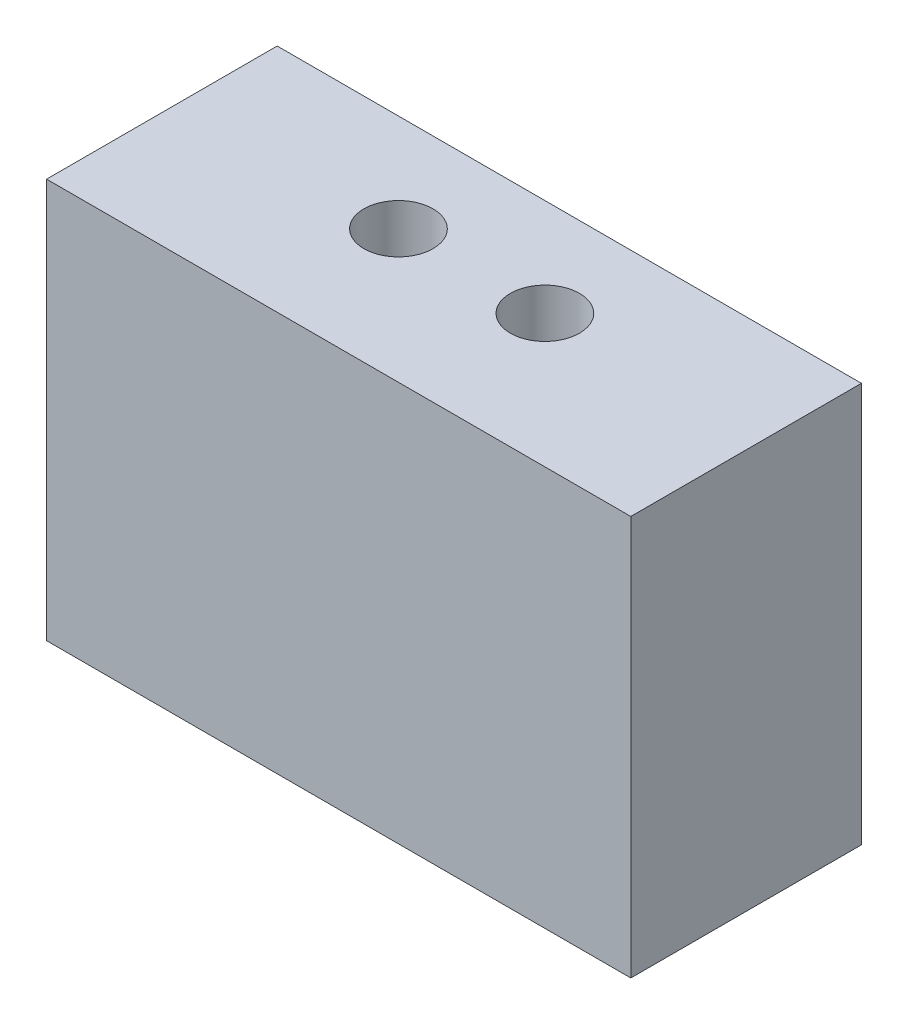
ISO-10303-21;
HEADER;
FILE_DESCRIPTION(('STEP AP214'),'2;1');
FILE_NAME('part.step','',(''),(''),'','','');
FILE_SCHEMA(('AUTOMOTIVE_DESIGN { 1 0 10303 214 1 1 1 1 }'));
ENDSEC;
DATA;
#1=APPLICATION_CONTEXT('core data for automotive mechanical design processes');
#2=APPLICATION_PROTOCOL_DEFINITION('international standard','automotive_design',2000,#1);
#3=PRODUCT_CONTEXT('',#1,'mechanical');
#4=PRODUCT('Part','Part','',(#3));
#5=PRODUCT_RELATED_PRODUCT_CATEGORY('part','',(#4));
#6=PRODUCT_DEFINITION_FORMATION('','',#4);
#7=PRODUCT_DEFINITION_CONTEXT('part definition',#1,'design');
#8=PRODUCT_DEFINITION('design','',#6,#7);
#9=PRODUCT_DEFINITION_SHAPE('','',#8);
#10=(LENGTH_UNIT() NAMED_UNIT(*) SI_UNIT(.MILLI.,.METRE.));
#11=(NAMED_UNIT(*) PLANE_ANGLE_UNIT() SI_UNIT($,.RADIAN.));
#12=(NAMED_UNIT(*) SI_UNIT($,.STERADIAN.) SOLID_ANGLE_UNIT());
#13=UNCERTAINTY_MEASURE_WITH_UNIT(LENGTH_MEASURE(1.E-05),#10,'distance_accuracy_value','');
#14=(GEOMETRIC_REPRESENTATION_CONTEXT(3) GLOBAL_UNCERTAINTY_ASSIGNED_CONTEXT((#13)) GLOBAL_UNIT_ASSIGNED_CONTEXT((#10,
#11,#12)) REPRESENTATION_CONTEXT('',''));
#15=CARTESIAN_POINT('',(0.,0.,0.));
#16=DIRECTION('',(0.,0.,1.));
#17=DIRECTION('',(1.,0.,0.));
#18=AXIS2_PLACEMENT_3D('',#15,#16,#17);
#19=CARTESIAN_POINT('',(-19.,52.,15.));
#20=DIRECTION('',(1.,0.,0.));
#21=DIRECTION('',(0.,1.,0.));
#22=AXIS2_PLACEMENT_3D('',#19,#20,#21);
#23=PLANE('',#22);
#24=DIRECTION('',(0.,-1.,0.));
#25=VECTOR('',#24,1.);
#26=CARTESIAN_POINT('',(-19.,52.,15.));
#27=LINE('',#26,#25);
#28=CARTESIAN_POINT('',(-19.,26.,15.));
#29=VERTEX_POINT('',#28);
#30=CARTESIAN_POINT('',(-19.,0.,15.));
#31=VERTEX_POINT('',#30);
#32=EDGE_CURVE('E79',#29,#31,#27,.T.);
#33=ORIENTED_EDGE('',*,*,#32,.F.);
#34=DIRECTION('',(0.,0.,1.));
#35=VECTOR('',#34,1.);
#36=CARTESIAN_POINT('',(-19.,26.,0.));
#37=LINE('',#36,#35);
#38=CARTESIAN_POINT('',(-19.,26.,0.));
#39=VERTEX_POINT('',#38);
#40=EDGE_CURVE('E69',#39,#29,#37,.T.);
#41=ORIENTED_EDGE('',*,*,#40,.F.);
#42=DIRECTION('',(0.,-1.,0.));
#43=VECTOR('',#42,1.);
#44=CARTESIAN_POINT('',(-19.,52.,0.));
#45=LINE('',#44,#43);
#46=CARTESIAN_POINT('',(-19.,0.,0.));
#47=VERTEX_POINT('',#46);
#48=EDGE_CURVE('E101',#39,#47,#45,.T.);
#49=ORIENTED_EDGE('',*,*,#48,.T.);
#50=DIRECTION('',(0.,0.,-1.));
#51=VECTOR('',#50,1.);
#52=CARTESIAN_POINT('',(-19.,0.,15.));
#53=LINE('',#52,#51);
#54=EDGE_CURVE('E11',#31,#47,#53,.T.);
#55=ORIENTED_EDGE('',*,*,#54,.F.);
#56=EDGE_LOOP('',(#33,#41,#49,#55));
#57=FACE_BOUND('',#56,.T.);
#58=ADVANCED_FACE('F30',(#57),#23,.F.);
#59=CARTESIAN_POINT('',(-19.,0.,15.));
#60=DIRECTION('',(0.,1.,0.));
#61=DIRECTION('',(0.,0.,1.));
#62=AXIS2_PLACEMENT_3D('',#59,#60,#61);
#63=PLANE('',#62);
#64=CARTESIAN_POINT('',(4.7625,0.,6.35));
#65=DIRECTION('',(0.,1.,0.));
#66=DIRECTION('',(0.,0.,1.));
#67=AXIS2_PLACEMENT_3D('',#64,#65,#66);
#68=CIRCLE('',#67,2.24789999999999);
#69=CARTESIAN_POINT('',(4.7625,0.,8.5979));
#70=VERTEX_POINT('',#69);
#71=EDGE_CURVE('E135',#70,#70,#68,.T.);
#72=ORIENTED_EDGE('',*,*,#71,.T.);
#73=EDGE_LOOP('',(#72));
#74=FACE_BOUND('',#73,.T.);
#75=CARTESIAN_POINT('',(-4.7625,0.,6.35));
#76=DIRECTION('',(0.,1.,0.));
#77=DIRECTION('',(0.,0.,1.));
#78=AXIS2_PLACEMENT_3D('',#75,#76,#77);
#79=CIRCLE('',#78,2.24789999999999);
#80=CARTESIAN_POINT('',(-4.7625,0.,8.5979));
#81=VERTEX_POINT('',#80);
#82=EDGE_CURVE('E139',#81,#81,#79,.T.);
#83=ORIENTED_EDGE('',*,*,#82,.T.);
#84=EDGE_LOOP('',(#83));
#85=FACE_BOUND('',#84,.T.);
#86=DIRECTION('',(1.,0.,0.));
#87=VECTOR('',#86,1.);
#88=CARTESIAN_POINT('',(-19.,0.,0.));
#89=LINE('',#88,#87);
#90=CARTESIAN_POINT('',(19.,0.,0.));
#91=VERTEX_POINT('',#90);
#92=EDGE_CURVE('E89',#47,#91,#89,.T.);
#93=ORIENTED_EDGE('',*,*,#92,.T.);
#94=DIRECTION('',(0.,0.,-1.));
#95=VECTOR('',#94,1.);
#96=CARTESIAN_POINT('',(19.,0.,15.));
#97=LINE('',#96,#95);
#98=CARTESIAN_POINT('',(19.,0.,15.));
#99=VERTEX_POINT('',#98);
#100=EDGE_CURVE('E37',#99,#91,#97,.T.);
#101=ORIENTED_EDGE('',*,*,#100,.F.);
#102=DIRECTION('',(1.,0.,0.));
#103=VECTOR('',#102,1.);
#104=CARTESIAN_POINT('',(-19.,0.,15.));
#105=LINE('',#104,#103);
#106=EDGE_CURVE('E52',#31,#99,#105,.T.);
#107=ORIENTED_EDGE('',*,*,#106,.F.);
#108=ORIENTED_EDGE('',*,*,#54,.T.);
#109=EDGE_LOOP('',(#93,#101,#107,#108));
#110=FACE_BOUND('',#109,.T.);
#111=ADVANCED_FACE('F106',(#74,#85,#110),#63,.F.);
#112=CARTESIAN_POINT('',(19.,52.,15.));
#113=DIRECTION('',(-1.,0.,0.));
#114=DIRECTION('',(0.,-1.,0.));
#115=AXIS2_PLACEMENT_3D('',#112,#113,#114);
#116=PLANE('',#115);
#117=DIRECTION('',(0.,1.,0.));
#118=VECTOR('',#117,1.);
#119=CARTESIAN_POINT('',(19.,52.,0.));
#120=LINE('',#119,#118);
#121=CARTESIAN_POINT('',(19.,26.,0.));
#122=VERTEX_POINT('',#121);
#123=EDGE_CURVE('E85',#91,#122,#120,.T.);
#124=ORIENTED_EDGE('',*,*,#123,.T.);
#125=DIRECTION('',(0.,0.,1.));
#126=VECTOR('',#125,1.);
#127=CARTESIAN_POINT('',(19.,26.,0.));
#128=LINE('',#127,#126);
#129=CARTESIAN_POINT('',(19.,26.,15.));
#130=VERTEX_POINT('',#129);
#131=EDGE_CURVE('E44',#122,#130,#128,.T.);
#132=ORIENTED_EDGE('',*,*,#131,.T.);
#133=DIRECTION('',(0.,1.,0.));
#134=VECTOR('',#133,1.);
#135=CARTESIAN_POINT('',(19.,52.,15.));
#136=LINE('',#135,#134);
#137=EDGE_CURVE('E81',#99,#130,#136,.T.);
#138=ORIENTED_EDGE('',*,*,#137,.F.);
#139=ORIENTED_EDGE('',*,*,#100,.T.);
#140=EDGE_LOOP('',(#124,#132,#138,#139));
#141=FACE_BOUND('',#140,.T.);
#142=ADVANCED_FACE('F96',(#141),#116,.F.);
#143=CARTESIAN_POINT('',(-19.,0.,15.));
#144=DIRECTION('',(0.,0.,1.));
#145=DIRECTION('',(1.,0.,0.));
#146=AXIS2_PLACEMENT_3D('',#143,#144,#145);
#147=PLANE('',#146);
#148=DIRECTION('',(1.,0.,0.));
#149=VECTOR('',#148,1.);
#150=CARTESIAN_POINT('',(-19.,26.,15.));
#151=LINE('',#150,#149);
#152=EDGE_CURVE('E72',#29,#130,#151,.T.);
#153=ORIENTED_EDGE('',*,*,#152,.F.);
#154=ORIENTED_EDGE('',*,*,#32,.T.);
#155=ORIENTED_EDGE('',*,*,#106,.T.);
#156=ORIENTED_EDGE('',*,*,#137,.T.);
#157=EDGE_LOOP('',(#153,#154,#155,#156));
#158=FACE_BOUND('',#157,.T.);
#159=ADVANCED_FACE('F78',(#158),#147,.T.);
#160=CARTESIAN_POINT('',(-19.,0.,0.));
#161=DIRECTION('',(0.,0.,1.));
#162=DIRECTION('',(1.,0.,0.));
#163=AXIS2_PLACEMENT_3D('',#160,#161,#162);
#164=PLANE('',#163);
#165=ORIENTED_EDGE('',*,*,#48,.F.);
#166=DIRECTION('',(1.,0.,0.));
#167=VECTOR('',#166,1.);
#168=CARTESIAN_POINT('',(-19.,26.,0.));
#169=LINE('',#168,#167);
#170=EDGE_CURVE('E73',#39,#122,#169,.T.);
#171=ORIENTED_EDGE('',*,*,#170,.T.);
#172=ORIENTED_EDGE('',*,*,#123,.F.);
#173=ORIENTED_EDGE('',*,*,#92,.F.);
#174=EDGE_LOOP('',(#165,#171,#172,#173));
#175=FACE_BOUND('',#174,.T.);
#176=ADVANCED_FACE('F100',(#175),#164,.F.);
#177=CARTESIAN_POINT('',(-19.,26.,0.));
#178=DIRECTION('',(0.,-1.,0.));
#179=DIRECTION('',(0.,0.,-1.));
#180=AXIS2_PLACEMENT_3D('',#177,#178,#179);
#181=PLANE('',#180);
#182=CARTESIAN_POINT('',(4.7625,26.,6.35));
#183=DIRECTION('',(0.,1.,0.));
#184=DIRECTION('',(0.,0.,1.));
#185=AXIS2_PLACEMENT_3D('',#182,#183,#184);
#186=CIRCLE('',#185,2.2479);
#187=CARTESIAN_POINT('',(4.7625,26.,8.5979));
#188=VERTEX_POINT('',#187);
#189=EDGE_CURVE('E138',#188,#188,#186,.T.);
#190=ORIENTED_EDGE('',*,*,#189,.F.);
#191=EDGE_LOOP('',(#190));
#192=FACE_BOUND('',#191,.T.);
#193=CARTESIAN_POINT('',(-4.7625,26.,6.35));
#194=DIRECTION('',(0.,1.,0.));
#195=DIRECTION('',(0.,0.,1.));
#196=AXIS2_PLACEMENT_3D('',#193,#194,#195);
#197=CIRCLE('',#196,2.2479);
#198=CARTESIAN_POINT('',(-4.7625,26.,8.5979));
#199=VERTEX_POINT('',#198);
#200=EDGE_CURVE('E82',#199,#199,#197,.T.);
#201=ORIENTED_EDGE('',*,*,#200,.F.);
#202=EDGE_LOOP('',(#201));
#203=FACE_BOUND('',#202,.T.);
#204=ORIENTED_EDGE('',*,*,#152,.T.);
#205=ORIENTED_EDGE('',*,*,#131,.F.);
#206=ORIENTED_EDGE('',*,*,#170,.F.);
#207=ORIENTED_EDGE('',*,*,#40,.T.);
#208=EDGE_LOOP('',(#204,#205,#206,#207));
#209=FACE_BOUND('',#208,.T.);
#210=ADVANCED_FACE('F71',(#192,#203,#209),#181,.F.);
#211=CARTESIAN_POINT('',(-4.7625,26.,6.35));
#212=DIRECTION('',(0.,1.,0.));
#213=DIRECTION('',(0.,0.,1.));
#214=AXIS2_PLACEMENT_3D('',#211,#212,#213);
#215=CYLINDRICAL_SURFACE('',#214,2.2479);
#216=ORIENTED_EDGE('',*,*,#82,.F.);
#217=EDGE_LOOP('',(#216));
#218=FACE_BOUND('',#217,.T.);
#219=ORIENTED_EDGE('',*,*,#200,.T.);
#220=EDGE_LOOP('',(#219));
#221=FACE_BOUND('',#220,.T.);
#222=ADVANCED_FACE('F123',(#218,#221),#215,.F.);
#223=CARTESIAN_POINT('',(4.7625,26.,6.35));
#224=DIRECTION('',(0.,1.,0.));
#225=DIRECTION('',(0.,0.,1.));
#226=AXIS2_PLACEMENT_3D('',#223,#224,#225);
#227=CYLINDRICAL_SURFACE('',#226,2.2479);
#228=ORIENTED_EDGE('',*,*,#71,.F.);
#229=EDGE_LOOP('',(#228));
#230=FACE_BOUND('',#229,.T.);
#231=ORIENTED_EDGE('',*,*,#189,.T.);
#232=EDGE_LOOP('',(#231));
#233=FACE_BOUND('',#232,.T.);
#234=ADVANCED_FACE('F127',(#230,#233),#227,.F.);
#235=CLOSED_SHELL('',(#58,#111,#142,#159,#176,#210,#222,#234));
#236=MANIFOLD_SOLID_BREP('B2',#235);
#237=ADVANCED_BREP_SHAPE_REPRESENTATION('',(#18,#236),#14);
#238=SHAPE_DEFINITION_REPRESENTATION(#9,#237);
ENDSEC;
END-ISO-10303-21;
